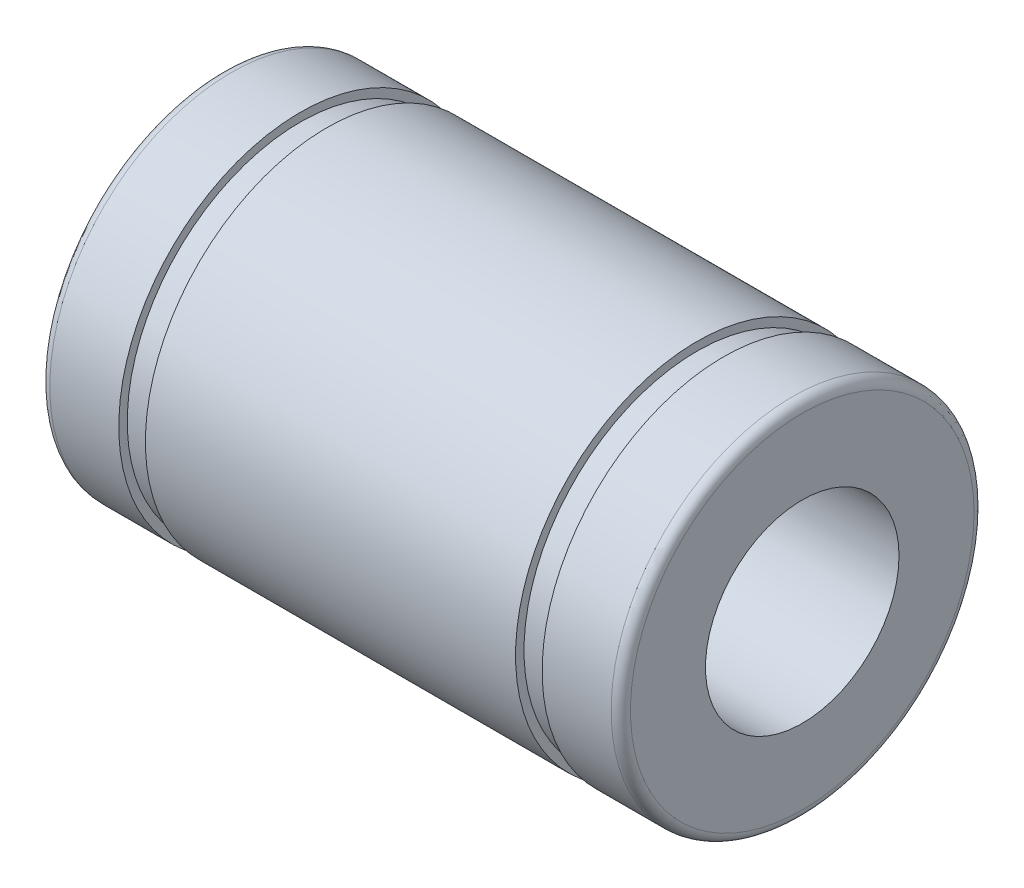
ISO-10303-21;
HEADER;
FILE_DESCRIPTION(('STEP AP214'),'2;1');
FILE_NAME('part.step','',(''),(''),'','','');
FILE_SCHEMA(('AUTOMOTIVE_DESIGN { 1 0 10303 214 1 1 1 1 }'));
ENDSEC;
DATA;
#1=APPLICATION_CONTEXT('core data for automotive mechanical design processes');
#2=APPLICATION_PROTOCOL_DEFINITION('international standard','automotive_design',2000,#1);
#3=PRODUCT_CONTEXT('',#1,'mechanical');
#4=PRODUCT('Part','Part','',(#3));
#5=PRODUCT_RELATED_PRODUCT_CATEGORY('part','',(#4));
#6=PRODUCT_DEFINITION_FORMATION('','',#4);
#7=PRODUCT_DEFINITION_CONTEXT('part definition',#1,'design');
#8=PRODUCT_DEFINITION('design','',#6,#7);
#9=PRODUCT_DEFINITION_SHAPE('','',#8);
#10=(LENGTH_UNIT() NAMED_UNIT(*) SI_UNIT(.MILLI.,.METRE.));
#11=(NAMED_UNIT(*) PLANE_ANGLE_UNIT() SI_UNIT($,.RADIAN.));
#12=(NAMED_UNIT(*) SI_UNIT($,.STERADIAN.) SOLID_ANGLE_UNIT());
#13=UNCERTAINTY_MEASURE_WITH_UNIT(LENGTH_MEASURE(1.E-05),#10,'distance_accuracy_value','');
#14=(GEOMETRIC_REPRESENTATION_CONTEXT(3) GLOBAL_UNCERTAINTY_ASSIGNED_CONTEXT((#13)) GLOBAL_UNIT_ASSIGNED_CONTEXT((#10,
#11,#12)) REPRESENTATION_CONTEXT('',''));
#15=CARTESIAN_POINT('',(0.,0.,0.));
#16=DIRECTION('',(0.,0.,1.));
#17=DIRECTION('',(1.,0.,0.));
#18=AXIS2_PLACEMENT_3D('',#15,#16,#17);
#19=CARTESIAN_POINT('',(0.4,0.,0.));
#20=DIRECTION('',(1.,0.,0.));
#21=DIRECTION('',(0.,0.,-1.));
#22=AXIS2_PLACEMENT_3D('',#19,#20,#21);
#23=TOROIDAL_SURFACE('',#22,7.1,0.4);
#24=CARTESIAN_POINT('',(0.,0.,0.));
#25=DIRECTION('',(1.,0.,0.));
#26=DIRECTION('',(0.,0.,-1.));
#27=AXIS2_PLACEMENT_3D('',#24,#25,#26);
#28=CIRCLE('',#27,7.1);
#29=CARTESIAN_POINT('',(0.,0.,-7.1));
#30=VERTEX_POINT('',#29);
#31=EDGE_CURVE('E10',#30,#30,#28,.T.);
#32=ORIENTED_EDGE('',*,*,#31,.T.);
#33=EDGE_LOOP('',(#32));
#34=FACE_BOUND('',#33,.T.);
#35=CARTESIAN_POINT('',(0.4,0.,0.));
#36=DIRECTION('',(1.,0.,0.));
#37=DIRECTION('',(0.,0.,-1.));
#38=AXIS2_PLACEMENT_3D('',#35,#36,#37);
#39=CIRCLE('',#38,7.5);
#40=CARTESIAN_POINT('',(0.4,0.,-7.5));
#41=VERTEX_POINT('',#40);
#42=EDGE_CURVE('E77',#41,#41,#39,.T.);
#43=ORIENTED_EDGE('',*,*,#42,.F.);
#44=EDGE_LOOP('',(#43));
#45=FACE_BOUND('',#44,.T.);
#46=ADVANCED_FACE('F31',(#34,#45),#23,.T.);
#47=CARTESIAN_POINT('',(0.,7.1,0.));
#48=DIRECTION('',(-1.,0.,0.));
#49=DIRECTION('',(0.,0.,1.));
#50=AXIS2_PLACEMENT_3D('',#47,#48,#49);
#51=PLANE('',#50);
#52=CARTESIAN_POINT('',(0.,0.,0.));
#53=DIRECTION('',(1.,0.,0.));
#54=DIRECTION('',(0.,0.,-1.));
#55=AXIS2_PLACEMENT_3D('',#52,#53,#54);
#56=CIRCLE('',#55,4.);
#57=CARTESIAN_POINT('',(0.,0.,-4.));
#58=VERTEX_POINT('',#57);
#59=EDGE_CURVE('E37',#58,#58,#56,.T.);
#60=ORIENTED_EDGE('',*,*,#59,.T.);
#61=EDGE_LOOP('',(#60));
#62=FACE_BOUND('',#61,.T.);
#63=ORIENTED_EDGE('',*,*,#31,.F.);
#64=EDGE_LOOP('',(#63));
#65=FACE_BOUND('',#64,.T.);
#66=ADVANCED_FACE('F85',(#62,#65),#51,.T.);
#67=CARTESIAN_POINT('',(-0.00125399362039767,0.,0.));
#68=DIRECTION('',(1.,0.,0.));
#69=DIRECTION('',(0.,0.,-1.));
#70=AXIS2_PLACEMENT_3D('',#67,#68,#69);
#71=CYLINDRICAL_SURFACE('',#70,4.);
#72=CARTESIAN_POINT('',(24.,0.,0.));
#73=DIRECTION('',(1.,0.,0.));
#74=DIRECTION('',(0.,0.,-1.));
#75=AXIS2_PLACEMENT_3D('',#72,#73,#74);
#76=CIRCLE('',#75,4.);
#77=CARTESIAN_POINT('',(24.,0.,-4.));
#78=VERTEX_POINT('',#77);
#79=EDGE_CURVE('E41',#78,#78,#76,.T.);
#80=ORIENTED_EDGE('',*,*,#79,.T.);
#81=EDGE_LOOP('',(#80));
#82=FACE_BOUND('',#81,.T.);
#83=ORIENTED_EDGE('',*,*,#59,.F.);
#84=EDGE_LOOP('',(#83));
#85=FACE_BOUND('',#84,.T.);
#86=ADVANCED_FACE('F89',(#82,#85),#71,.F.);
#87=CARTESIAN_POINT('',(24.,4.,0.));
#88=DIRECTION('',(1.,0.,0.));
#89=DIRECTION('',(0.,0.,-1.));
#90=AXIS2_PLACEMENT_3D('',#87,#88,#89);
#91=PLANE('',#90);
#92=CARTESIAN_POINT('',(24.,0.,0.));
#93=DIRECTION('',(1.,0.,0.));
#94=DIRECTION('',(0.,0.,-1.));
#95=AXIS2_PLACEMENT_3D('',#92,#93,#94);
#96=CIRCLE('',#95,7.1);
#97=CARTESIAN_POINT('',(24.,0.,-7.1));
#98=VERTEX_POINT('',#97);
#99=EDGE_CURVE('E45',#98,#98,#96,.T.);
#100=ORIENTED_EDGE('',*,*,#99,.T.);
#101=EDGE_LOOP('',(#100));
#102=FACE_BOUND('',#101,.T.);
#103=ORIENTED_EDGE('',*,*,#79,.F.);
#104=EDGE_LOOP('',(#103));
#105=FACE_BOUND('',#104,.T.);
#106=ADVANCED_FACE('F93',(#102,#105),#91,.T.);
#107=CARTESIAN_POINT('',(23.6,0.,0.));
#108=DIRECTION('',(1.,0.,0.));
#109=DIRECTION('',(0.,0.,-1.));
#110=AXIS2_PLACEMENT_3D('',#107,#108,#109);
#111=TOROIDAL_SURFACE('',#110,7.1,0.399999999999999);
#112=CARTESIAN_POINT('',(23.6,0.,0.));
#113=DIRECTION('',(1.,0.,0.));
#114=DIRECTION('',(0.,0.,-1.));
#115=AXIS2_PLACEMENT_3D('',#112,#113,#114);
#116=CIRCLE('',#115,7.5);
#117=CARTESIAN_POINT('',(23.6,0.,-7.5));
#118=VERTEX_POINT('',#117);
#119=EDGE_CURVE('E50',#118,#118,#116,.T.);
#120=ORIENTED_EDGE('',*,*,#119,.T.);
#121=EDGE_LOOP('',(#120));
#122=FACE_BOUND('',#121,.T.);
#123=ORIENTED_EDGE('',*,*,#99,.F.);
#124=EDGE_LOOP('',(#123));
#125=FACE_BOUND('',#124,.T.);
#126=ADVANCED_FACE('F100',(#122,#125),#111,.T.);
#127=CARTESIAN_POINT('',(-0.00125399362039767,0.,0.));
#128=DIRECTION('',(1.,0.,0.));
#129=DIRECTION('',(0.,0.,-1.));
#130=AXIS2_PLACEMENT_3D('',#127,#128,#129);
#131=CYLINDRICAL_SURFACE('',#130,7.5);
#132=CARTESIAN_POINT('',(20.75,0.,0.));
#133=DIRECTION('',(1.,0.,0.));
#134=DIRECTION('',(0.,0.,-1.));
#135=AXIS2_PLACEMENT_3D('',#132,#133,#134);
#136=CIRCLE('',#135,7.5);
#137=CARTESIAN_POINT('',(20.75,0.,-7.5));
#138=VERTEX_POINT('',#137);
#139=EDGE_CURVE('E53',#138,#138,#136,.T.);
#140=ORIENTED_EDGE('',*,*,#139,.T.);
#141=EDGE_LOOP('',(#140));
#142=FACE_BOUND('',#141,.T.);
#143=ORIENTED_EDGE('',*,*,#119,.F.);
#144=EDGE_LOOP('',(#143));
#145=FACE_BOUND('',#144,.T.);
#146=ADVANCED_FACE('F104',(#142,#145),#131,.T.);
#147=CARTESIAN_POINT('',(20.75,7.5,0.));
#148=DIRECTION('',(-1.,0.,0.));
#149=DIRECTION('',(0.,0.,1.));
#150=AXIS2_PLACEMENT_3D('',#147,#148,#149);
#151=PLANE('',#150);
#152=CARTESIAN_POINT('',(20.75,0.,0.));
#153=DIRECTION('',(1.,0.,0.));
#154=DIRECTION('',(0.,0.,-1.));
#155=AXIS2_PLACEMENT_3D('',#152,#153,#154);
#156=CIRCLE('',#155,7.15);
#157=CARTESIAN_POINT('',(20.75,0.,-7.15));
#158=VERTEX_POINT('',#157);
#159=EDGE_CURVE('E56',#158,#158,#156,.T.);
#160=ORIENTED_EDGE('',*,*,#159,.T.);
#161=EDGE_LOOP('',(#160));
#162=FACE_BOUND('',#161,.T.);
#163=ORIENTED_EDGE('',*,*,#139,.F.);
#164=EDGE_LOOP('',(#163));
#165=FACE_BOUND('',#164,.T.);
#166=ADVANCED_FACE('F108',(#162,#165),#151,.T.);
#167=CARTESIAN_POINT('',(-0.00125399362039767,0.,0.));
#168=DIRECTION('',(1.,0.,0.));
#169=DIRECTION('',(0.,0.,-1.));
#170=AXIS2_PLACEMENT_3D('',#167,#168,#169);
#171=CYLINDRICAL_SURFACE('',#170,7.15);
#172=CARTESIAN_POINT('',(19.65,0.,0.));
#173=DIRECTION('',(1.,0.,0.));
#174=DIRECTION('',(0.,0.,-1.));
#175=AXIS2_PLACEMENT_3D('',#172,#173,#174);
#176=CIRCLE('',#175,7.15);
#177=CARTESIAN_POINT('',(19.65,0.,-7.15));
#178=VERTEX_POINT('',#177);
#179=EDGE_CURVE('E59',#178,#178,#176,.T.);
#180=ORIENTED_EDGE('',*,*,#179,.T.);
#181=EDGE_LOOP('',(#180));
#182=FACE_BOUND('',#181,.T.);
#183=ORIENTED_EDGE('',*,*,#159,.F.);
#184=EDGE_LOOP('',(#183));
#185=FACE_BOUND('',#184,.T.);
#186=ADVANCED_FACE('F112',(#182,#185),#171,.T.);
#187=CARTESIAN_POINT('',(19.65,7.15,0.));
#188=DIRECTION('',(1.,0.,0.));
#189=DIRECTION('',(0.,0.,-1.));
#190=AXIS2_PLACEMENT_3D('',#187,#188,#189);
#191=PLANE('',#190);
#192=CARTESIAN_POINT('',(19.65,0.,0.));
#193=DIRECTION('',(1.,0.,0.));
#194=DIRECTION('',(0.,0.,-1.));
#195=AXIS2_PLACEMENT_3D('',#192,#193,#194);
#196=CIRCLE('',#195,7.5);
#197=CARTESIAN_POINT('',(19.65,0.,-7.5));
#198=VERTEX_POINT('',#197);
#199=EDGE_CURVE('E62',#198,#198,#196,.T.);
#200=ORIENTED_EDGE('',*,*,#199,.T.);
#201=EDGE_LOOP('',(#200));
#202=FACE_BOUND('',#201,.T.);
#203=ORIENTED_EDGE('',*,*,#179,.F.);
#204=EDGE_LOOP('',(#203));
#205=FACE_BOUND('',#204,.T.);
#206=ADVANCED_FACE('F116',(#202,#205),#191,.T.);
#207=CARTESIAN_POINT('',(-0.00125399362039767,0.,0.));
#208=DIRECTION('',(1.,0.,0.));
#209=DIRECTION('',(0.,0.,-1.));
#210=AXIS2_PLACEMENT_3D('',#207,#208,#209);
#211=CYLINDRICAL_SURFACE('',#210,7.5);
#212=CARTESIAN_POINT('',(4.35,0.,0.));
#213=DIRECTION('',(1.,0.,0.));
#214=DIRECTION('',(0.,0.,-1.));
#215=AXIS2_PLACEMENT_3D('',#212,#213,#214);
#216=CIRCLE('',#215,7.5);
#217=CARTESIAN_POINT('',(4.35,0.,-7.5));
#218=VERTEX_POINT('',#217);
#219=EDGE_CURVE('E65',#218,#218,#216,.T.);
#220=ORIENTED_EDGE('',*,*,#219,.T.);
#221=EDGE_LOOP('',(#220));
#222=FACE_BOUND('',#221,.T.);
#223=ORIENTED_EDGE('',*,*,#199,.F.);
#224=EDGE_LOOP('',(#223));
#225=FACE_BOUND('',#224,.T.);
#226=ADVANCED_FACE('F120',(#222,#225),#211,.T.);
#227=CARTESIAN_POINT('',(4.35,7.5,0.));
#228=DIRECTION('',(-1.,0.,0.));
#229=DIRECTION('',(0.,0.,1.));
#230=AXIS2_PLACEMENT_3D('',#227,#228,#229);
#231=PLANE('',#230);
#232=CARTESIAN_POINT('',(4.35,0.,0.));
#233=DIRECTION('',(1.,0.,0.));
#234=DIRECTION('',(0.,0.,-1.));
#235=AXIS2_PLACEMENT_3D('',#232,#233,#234);
#236=CIRCLE('',#235,7.15);
#237=CARTESIAN_POINT('',(4.35,0.,-7.15));
#238=VERTEX_POINT('',#237);
#239=EDGE_CURVE('E68',#238,#238,#236,.T.);
#240=ORIENTED_EDGE('',*,*,#239,.T.);
#241=EDGE_LOOP('',(#240));
#242=FACE_BOUND('',#241,.T.);
#243=ORIENTED_EDGE('',*,*,#219,.F.);
#244=EDGE_LOOP('',(#243));
#245=FACE_BOUND('',#244,.T.);
#246=ADVANCED_FACE('F124',(#242,#245),#231,.T.);
#247=CARTESIAN_POINT('',(-0.00125399362039767,0.,0.));
#248=DIRECTION('',(1.,0.,0.));
#249=DIRECTION('',(0.,0.,-1.));
#250=AXIS2_PLACEMENT_3D('',#247,#248,#249);
#251=CYLINDRICAL_SURFACE('',#250,7.15);
#252=CARTESIAN_POINT('',(3.25,0.,0.));
#253=DIRECTION('',(1.,0.,0.));
#254=DIRECTION('',(0.,0.,-1.));
#255=AXIS2_PLACEMENT_3D('',#252,#253,#254);
#256=CIRCLE('',#255,7.15);
#257=CARTESIAN_POINT('',(3.25,0.,-7.15));
#258=VERTEX_POINT('',#257);
#259=EDGE_CURVE('E71',#258,#258,#256,.T.);
#260=ORIENTED_EDGE('',*,*,#259,.T.);
#261=EDGE_LOOP('',(#260));
#262=FACE_BOUND('',#261,.T.);
#263=ORIENTED_EDGE('',*,*,#239,.F.);
#264=EDGE_LOOP('',(#263));
#265=FACE_BOUND('',#264,.T.);
#266=ADVANCED_FACE('F128',(#262,#265),#251,.T.);
#267=CARTESIAN_POINT('',(3.25,7.15,0.));
#268=DIRECTION('',(1.,0.,0.));
#269=DIRECTION('',(0.,0.,-1.));
#270=AXIS2_PLACEMENT_3D('',#267,#268,#269);
#271=PLANE('',#270);
#272=CARTESIAN_POINT('',(3.25,0.,0.));
#273=DIRECTION('',(1.,0.,0.));
#274=DIRECTION('',(0.,0.,-1.));
#275=AXIS2_PLACEMENT_3D('',#272,#273,#274);
#276=CIRCLE('',#275,7.5);
#277=CARTESIAN_POINT('',(3.25,0.,-7.5));
#278=VERTEX_POINT('',#277);
#279=EDGE_CURVE('E74',#278,#278,#276,.T.);
#280=ORIENTED_EDGE('',*,*,#279,.T.);
#281=EDGE_LOOP('',(#280));
#282=FACE_BOUND('',#281,.T.);
#283=ORIENTED_EDGE('',*,*,#259,.F.);
#284=EDGE_LOOP('',(#283));
#285=FACE_BOUND('',#284,.T.);
#286=ADVANCED_FACE('F132',(#282,#285),#271,.T.);
#287=CARTESIAN_POINT('',(-0.00125399362039767,0.,0.));
#288=DIRECTION('',(1.,0.,0.));
#289=DIRECTION('',(0.,0.,-1.));
#290=AXIS2_PLACEMENT_3D('',#287,#288,#289);
#291=CYLINDRICAL_SURFACE('',#290,7.5);
#292=ORIENTED_EDGE('',*,*,#42,.T.);
#293=EDGE_LOOP('',(#292));
#294=FACE_BOUND('',#293,.T.);
#295=ORIENTED_EDGE('',*,*,#279,.F.);
#296=EDGE_LOOP('',(#295));
#297=FACE_BOUND('',#296,.T.);
#298=ADVANCED_FACE('F81',(#294,#297),#291,.T.);
#299=CLOSED_SHELL('',(#46,#66,#86,#106,#126,#146,#166,#186,#206,#226,#246,#266,#286,#298));
#300=MANIFOLD_SOLID_BREP('B2',#299);
#301=ADVANCED_BREP_SHAPE_REPRESENTATION('',(#18,#300),#14);
#302=SHAPE_DEFINITION_REPRESENTATION(#9,#301);
ENDSEC;
END-ISO-10303-21;
